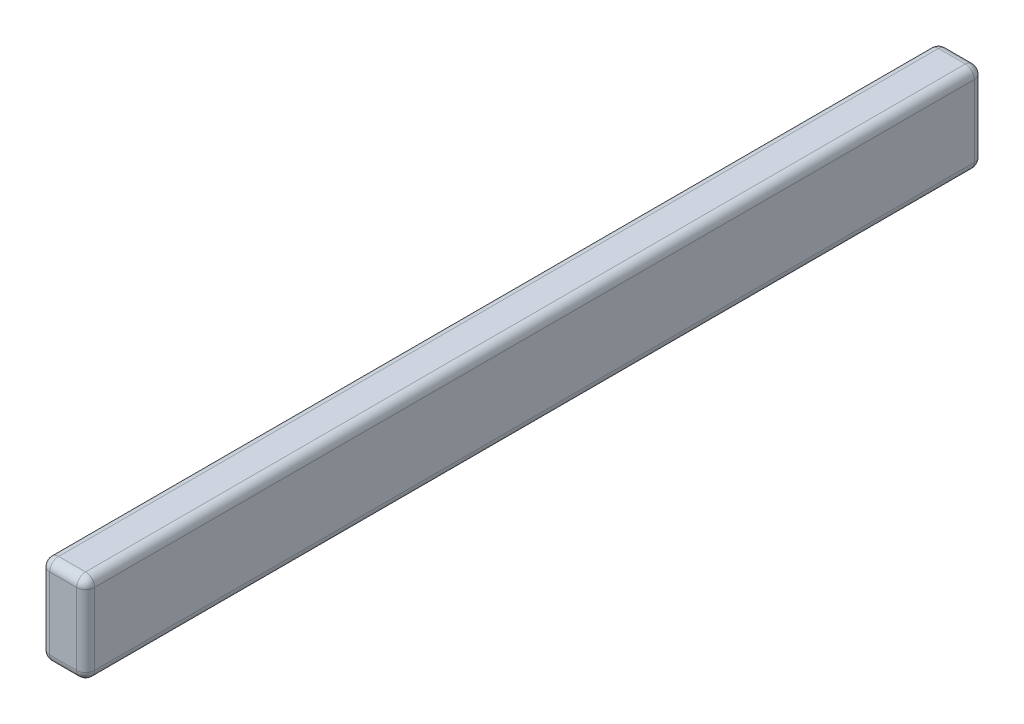
ISO-10303-21;
HEADER;
FILE_DESCRIPTION(('STEP AP214'),'2;1');
FILE_NAME('part.step','',(''),(''),'','','');
FILE_SCHEMA(('AUTOMOTIVE_DESIGN { 1 0 10303 214 1 1 1 1 }'));
ENDSEC;
DATA;
#1=APPLICATION_CONTEXT('core data for automotive mechanical design processes');
#2=APPLICATION_PROTOCOL_DEFINITION('international standard','automotive_design',2000,#1);
#3=PRODUCT_CONTEXT('',#1,'mechanical');
#4=PRODUCT('Part','Part','',(#3));
#5=PRODUCT_RELATED_PRODUCT_CATEGORY('part','',(#4));
#6=PRODUCT_DEFINITION_FORMATION('','',#4);
#7=PRODUCT_DEFINITION_CONTEXT('part definition',#1,'design');
#8=PRODUCT_DEFINITION('design','',#6,#7);
#9=PRODUCT_DEFINITION_SHAPE('','',#8);
#10=(LENGTH_UNIT() NAMED_UNIT(*) SI_UNIT(.MILLI.,.METRE.));
#11=(NAMED_UNIT(*) PLANE_ANGLE_UNIT() SI_UNIT($,.RADIAN.));
#12=(NAMED_UNIT(*) SI_UNIT($,.STERADIAN.) SOLID_ANGLE_UNIT());
#13=UNCERTAINTY_MEASURE_WITH_UNIT(LENGTH_MEASURE(1.E-05),#10,'distance_accuracy_value','');
#14=(GEOMETRIC_REPRESENTATION_CONTEXT(3) GLOBAL_UNCERTAINTY_ASSIGNED_CONTEXT((#13)) GLOBAL_UNIT_ASSIGNED_CONTEXT((#10,
#11,#12)) REPRESENTATION_CONTEXT('',''));
#15=CARTESIAN_POINT('',(0.,0.,0.));
#16=DIRECTION('',(0.,0.,1.));
#17=DIRECTION('',(1.,0.,0.));
#18=AXIS2_PLACEMENT_3D('',#15,#16,#17);
#19=CARTESIAN_POINT('',(-28.2934494803903,24.9697429906542,1000.));
#20=DIRECTION('',(1.,0.,0.));
#21=DIRECTION('',(0.,1.,0.));
#22=AXIS2_PLACEMENT_3D('',#19,#20,#21);
#23=PLANE('',#22);
#24=DIRECTION('',(0.,0.,-1.));
#25=VECTOR('',#24,1.);
#26=CARTESIAN_POINT('',(-28.2934494803903,-65.0302570093458,1000.));
#27=LINE('',#26,#25);
#28=CARTESIAN_POINT('',(-28.2934494803903,-65.0302570093458,10.));
#29=VERTEX_POINT('',#28);
#30=CARTESIAN_POINT('',(-28.2934494803903,-65.0302570093458,990.));
#31=VERTEX_POINT('',#30);
#32=EDGE_CURVE('E250',#29,#31,#27,.F.);
#33=ORIENTED_EDGE('',*,*,#32,.T.);
#34=DIRECTION('',(0.,-1.,0.));
#35=VECTOR('',#34,1.);
#36=CARTESIAN_POINT('',(-28.2934494803903,14.9697429906542,990.));
#37=LINE('',#36,#35);
#38=CARTESIAN_POINT('',(-28.2934494803903,14.9697429906542,990.));
#39=VERTEX_POINT('',#38);
#40=EDGE_CURVE('E11',#31,#39,#37,.F.);
#41=ORIENTED_EDGE('',*,*,#40,.T.);
#42=DIRECTION('',(0.,0.,-1.));
#43=VECTOR('',#42,1.);
#44=CARTESIAN_POINT('',(-28.2934494803903,14.9697429906542,0.));
#45=LINE('',#44,#43);
#46=CARTESIAN_POINT('',(-28.2934494803903,14.9697429906542,10.));
#47=VERTEX_POINT('',#46);
#48=EDGE_CURVE('E252',#39,#47,#45,.T.);
#49=ORIENTED_EDGE('',*,*,#48,.T.);
#50=DIRECTION('',(0.,-1.,0.));
#51=VECTOR('',#50,1.);
#52=CARTESIAN_POINT('',(-28.2934494803903,24.9697429906542,10.));
#53=LINE('',#52,#51);
#54=EDGE_CURVE('E44',#47,#29,#53,.T.);
#55=ORIENTED_EDGE('',*,*,#54,.T.);
#56=EDGE_LOOP('',(#33,#41,#49,#55));
#57=FACE_BOUND('',#56,.T.);
#58=ADVANCED_FACE('F35',(#57),#23,.F.);
#59=CARTESIAN_POINT('',(-28.2934494803903,-75.0302570093458,1000.));
#60=DIRECTION('',(0.,1.,0.));
#61=DIRECTION('',(0.,0.,1.));
#62=AXIS2_PLACEMENT_3D('',#59,#60,#61);
#63=PLANE('',#62);
#64=DIRECTION('',(0.,0.,-1.));
#65=VECTOR('',#64,1.);
#66=CARTESIAN_POINT('',(11.7065505196098,-75.0302570093458,1000.));
#67=LINE('',#66,#65);
#68=CARTESIAN_POINT('',(11.7065505196098,-75.0302570093458,10.));
#69=VERTEX_POINT('',#68);
#70=CARTESIAN_POINT('',(11.7065505196098,-75.0302570093458,990.));
#71=VERTEX_POINT('',#70);
#72=EDGE_CURVE('E156',#69,#71,#67,.F.);
#73=ORIENTED_EDGE('',*,*,#72,.T.);
#74=DIRECTION('',(1.,0.,0.));
#75=VECTOR('',#74,1.);
#76=CARTESIAN_POINT('',(-18.2934494803903,-75.0302570093458,990.));
#77=LINE('',#76,#75);
#78=CARTESIAN_POINT('',(-18.2934494803903,-75.0302570093458,990.));
#79=VERTEX_POINT('',#78);
#80=EDGE_CURVE('E228',#71,#79,#77,.F.);
#81=ORIENTED_EDGE('',*,*,#80,.T.);
#82=DIRECTION('',(0.,0.,-1.));
#83=VECTOR('',#82,1.);
#84=CARTESIAN_POINT('',(-18.2934494803903,-75.0302570093458,1000.));
#85=LINE('',#84,#83);
#86=CARTESIAN_POINT('',(-18.2934494803903,-75.0302570093458,10.));
#87=VERTEX_POINT('',#86);
#88=EDGE_CURVE('E272',#79,#87,#85,.T.);
#89=ORIENTED_EDGE('',*,*,#88,.T.);
#90=DIRECTION('',(1.,0.,0.));
#91=VECTOR('',#90,1.);
#92=CARTESIAN_POINT('',(-28.2934494803903,-75.0302570093458,10.));
#93=LINE('',#92,#91);
#94=EDGE_CURVE('E225',#87,#69,#93,.T.);
#95=ORIENTED_EDGE('',*,*,#94,.T.);
#96=EDGE_LOOP('',(#73,#81,#89,#95));
#97=FACE_BOUND('',#96,.T.);
#98=ADVANCED_FACE('F271',(#97),#63,.F.);
#99=CARTESIAN_POINT('',(21.7065505196098,24.9697429906542,1000.));
#100=DIRECTION('',(1.,0.,0.));
#101=DIRECTION('',(0.,1.,0.));
#102=AXIS2_PLACEMENT_3D('',#99,#100,#101);
#103=PLANE('',#102);
#104=DIRECTION('',(0.,0.,-1.));
#105=VECTOR('',#104,1.);
#106=CARTESIAN_POINT('',(21.7065505196098,14.9697429906542,1000.));
#107=LINE('',#106,#105);
#108=CARTESIAN_POINT('',(21.7065505196098,14.9697429906542,10.));
#109=VERTEX_POINT('',#108);
#110=CARTESIAN_POINT('',(21.7065505196098,14.9697429906542,990.));
#111=VERTEX_POINT('',#110);
#112=EDGE_CURVE('E260',#109,#111,#107,.F.);
#113=ORIENTED_EDGE('',*,*,#112,.T.);
#114=DIRECTION('',(0.,-1.,0.));
#115=VECTOR('',#114,1.);
#116=CARTESIAN_POINT('',(21.7065505196098,24.9697429906542,990.));
#117=LINE('',#116,#115);
#118=CARTESIAN_POINT('',(21.7065505196098,-65.0302570093458,990.));
#119=VERTEX_POINT('',#118);
#120=EDGE_CURVE('E215',#111,#119,#117,.T.);
#121=ORIENTED_EDGE('',*,*,#120,.T.);
#122=DIRECTION('',(0.,0.,-1.));
#123=VECTOR('',#122,1.);
#124=CARTESIAN_POINT('',(21.7065505196098,-65.0302570093458,0.));
#125=LINE('',#124,#123);
#126=CARTESIAN_POINT('',(21.7065505196098,-65.0302570093458,10.));
#127=VERTEX_POINT('',#126);
#128=EDGE_CURVE('E285',#119,#127,#125,.T.);
#129=ORIENTED_EDGE('',*,*,#128,.T.);
#130=DIRECTION('',(0.,-1.,0.));
#131=VECTOR('',#130,1.);
#132=CARTESIAN_POINT('',(21.7065505196098,14.9697429906542,10.));
#133=LINE('',#132,#131);
#134=EDGE_CURVE('E245',#127,#109,#133,.F.);
#135=ORIENTED_EDGE('',*,*,#134,.T.);
#136=EDGE_LOOP('',(#113,#121,#129,#135));
#137=FACE_BOUND('',#136,.T.);
#138=ADVANCED_FACE('F284',(#137),#103,.T.);
#139=CARTESIAN_POINT('',(-28.2934494803903,24.9697429906542,1000.));
#140=DIRECTION('',(0.,1.,0.));
#141=DIRECTION('',(-1.,0.,0.));
#142=AXIS2_PLACEMENT_3D('',#139,#140,#141);
#143=PLANE('',#142);
#144=DIRECTION('',(0.,0.,-1.));
#145=VECTOR('',#144,1.);
#146=CARTESIAN_POINT('',(-18.2934494803903,24.9697429906542,1000.));
#147=LINE('',#146,#145);
#148=CARTESIAN_POINT('',(-18.2934494803903,24.9697429906542,10.));
#149=VERTEX_POINT('',#148);
#150=CARTESIAN_POINT('',(-18.2934494803903,24.9697429906542,990.));
#151=VERTEX_POINT('',#150);
#152=EDGE_CURVE('E131',#149,#151,#147,.F.);
#153=ORIENTED_EDGE('',*,*,#152,.T.);
#154=DIRECTION('',(1.,0.,0.));
#155=VECTOR('',#154,1.);
#156=CARTESIAN_POINT('',(-28.2934494803903,24.9697429906542,990.));
#157=LINE('',#156,#155);
#158=CARTESIAN_POINT('',(11.7065505196098,24.9697429906542,990.));
#159=VERTEX_POINT('',#158);
#160=EDGE_CURVE('E135',#151,#159,#157,.T.);
#161=ORIENTED_EDGE('',*,*,#160,.T.);
#162=DIRECTION('',(0.,0.,-1.));
#163=VECTOR('',#162,1.);
#164=CARTESIAN_POINT('',(11.7065505196098,24.9697429906542,1000.));
#165=LINE('',#164,#163);
#166=CARTESIAN_POINT('',(11.7065505196098,24.9697429906542,10.));
#167=VERTEX_POINT('',#166);
#168=EDGE_CURVE('E133',#159,#167,#165,.T.);
#169=ORIENTED_EDGE('',*,*,#168,.T.);
#170=DIRECTION('',(1.,0.,0.));
#171=VECTOR('',#170,1.);
#172=CARTESIAN_POINT('',(-18.2934494803903,24.9697429906542,10.));
#173=LINE('',#172,#171);
#174=EDGE_CURVE('E128',#167,#149,#173,.F.);
#175=ORIENTED_EDGE('',*,*,#174,.T.);
#176=EDGE_LOOP('',(#153,#161,#169,#175));
#177=FACE_BOUND('',#176,.T.);
#178=ADVANCED_FACE('F130',(#177),#143,.T.);
#179=CARTESIAN_POINT('',(0.,0.,1000.));
#180=DIRECTION('',(0.,0.,1.));
#181=DIRECTION('',(1.,0.,0.));
#182=AXIS2_PLACEMENT_3D('',#179,#180,#181);
#183=PLANE('',#182);
#184=DIRECTION('',(1.,0.,0.));
#185=VECTOR('',#184,1.);
#186=CARTESIAN_POINT('',(11.7065505196098,-65.0302570093458,1000.));
#187=LINE('',#186,#185);
#188=CARTESIAN_POINT('',(-18.2934494803903,-65.0302570093458,1000.));
#189=VERTEX_POINT('',#188);
#190=CARTESIAN_POINT('',(11.7065505196098,-65.0302570093458,1000.));
#191=VERTEX_POINT('',#190);
#192=EDGE_CURVE('E300',#189,#191,#187,.T.);
#193=ORIENTED_EDGE('',*,*,#192,.T.);
#194=DIRECTION('',(0.,-1.,0.));
#195=VECTOR('',#194,1.);
#196=CARTESIAN_POINT('',(11.7065505196098,0.,1000.));
#197=LINE('',#196,#195);
#198=CARTESIAN_POINT('',(11.7065505196098,14.9697429906542,1000.));
#199=VERTEX_POINT('',#198);
#200=EDGE_CURVE('E216',#191,#199,#197,.F.);
#201=ORIENTED_EDGE('',*,*,#200,.T.);
#202=DIRECTION('',(1.,0.,0.));
#203=VECTOR('',#202,1.);
#204=CARTESIAN_POINT('',(0.,14.9697429906542,1000.));
#205=LINE('',#204,#203);
#206=CARTESIAN_POINT('',(-18.2934494803903,14.9697429906542,1000.));
#207=VERTEX_POINT('',#206);
#208=EDGE_CURVE('E302',#199,#207,#205,.F.);
#209=ORIENTED_EDGE('',*,*,#208,.T.);
#210=DIRECTION('',(0.,-1.,0.));
#211=VECTOR('',#210,1.);
#212=CARTESIAN_POINT('',(-18.2934494803903,-65.0302570093458,1000.));
#213=LINE('',#212,#211);
#214=EDGE_CURVE('E298',#207,#189,#213,.T.);
#215=ORIENTED_EDGE('',*,*,#214,.T.);
#216=EDGE_LOOP('',(#193,#201,#209,#215));
#217=FACE_BOUND('',#216,.T.);
#218=ADVANCED_FACE('F307',(#217),#183,.T.);
#219=CARTESIAN_POINT('',(0.,0.,0.));
#220=DIRECTION('',(0.,0.,1.));
#221=DIRECTION('',(1.,0.,0.));
#222=AXIS2_PLACEMENT_3D('',#219,#220,#221);
#223=PLANE('',#222);
#224=DIRECTION('',(1.,0.,0.));
#225=VECTOR('',#224,1.);
#226=CARTESIAN_POINT('',(11.7065505196098,14.9697429906542,0.));
#227=LINE('',#226,#225);
#228=CARTESIAN_POINT('',(-18.2934494803903,14.9697429906542,0.));
#229=VERTEX_POINT('',#228);
#230=CARTESIAN_POINT('',(11.7065505196098,14.9697429906542,0.));
#231=VERTEX_POINT('',#230);
#232=EDGE_CURVE('E159',#229,#231,#227,.T.);
#233=ORIENTED_EDGE('',*,*,#232,.T.);
#234=DIRECTION('',(0.,-1.,0.));
#235=VECTOR('',#234,1.);
#236=CARTESIAN_POINT('',(11.7065505196098,-65.0302570093458,0.));
#237=LINE('',#236,#235);
#238=CARTESIAN_POINT('',(11.7065505196098,-65.0302570093458,0.));
#239=VERTEX_POINT('',#238);
#240=EDGE_CURVE('E60',#231,#239,#237,.T.);
#241=ORIENTED_EDGE('',*,*,#240,.T.);
#242=DIRECTION('',(1.,0.,0.));
#243=VECTOR('',#242,1.);
#244=CARTESIAN_POINT('',(0.,-65.0302570093458,0.));
#245=LINE('',#244,#243);
#246=CARTESIAN_POINT('',(-18.2934494803903,-65.0302570093458,0.));
#247=VERTEX_POINT('',#246);
#248=EDGE_CURVE('E241',#239,#247,#245,.F.);
#249=ORIENTED_EDGE('',*,*,#248,.T.);
#250=DIRECTION('',(0.,-1.,0.));
#251=VECTOR('',#250,1.);
#252=CARTESIAN_POINT('',(-18.2934494803903,0.,0.));
#253=LINE('',#252,#251);
#254=EDGE_CURVE('E239',#247,#229,#253,.F.);
#255=ORIENTED_EDGE('',*,*,#254,.T.);
#256=EDGE_LOOP('',(#233,#241,#249,#255));
#257=FACE_BOUND('',#256,.T.);
#258=ADVANCED_FACE('F268',(#257),#223,.F.);
#259=CARTESIAN_POINT('',(11.7065505196098,14.9697429906542,1000.));
#260=DIRECTION('',(0.,0.,-1.));
#261=DIRECTION('',(-1.,0.,0.));
#262=AXIS2_PLACEMENT_3D('',#259,#260,#261);
#263=CYLINDRICAL_SURFACE('',#262,10.);
#264=ORIENTED_EDGE('',*,*,#168,.F.);
#265=CARTESIAN_POINT('',(11.7065505196098,14.9697429906542,990.));
#266=DIRECTION('',(0.,0.,-1.));
#267=DIRECTION('',(-1.,0.,0.));
#268=AXIS2_PLACEMENT_3D('',#265,#266,#267);
#269=CIRCLE('',#268,10.);
#270=EDGE_CURVE('E230',#159,#111,#269,.T.);
#271=ORIENTED_EDGE('',*,*,#270,.T.);
#272=ORIENTED_EDGE('',*,*,#112,.F.);
#273=CARTESIAN_POINT('',(11.7065505196098,14.9697429906542,10.));
#274=DIRECTION('',(0.,0.,-1.));
#275=DIRECTION('',(-1.,0.,0.));
#276=AXIS2_PLACEMENT_3D('',#273,#274,#275);
#277=CIRCLE('',#276,10.);
#278=EDGE_CURVE('E288',#109,#167,#277,.F.);
#279=ORIENTED_EDGE('',*,*,#278,.T.);
#280=EDGE_LOOP('',(#264,#271,#272,#279));
#281=FACE_BOUND('',#280,.T.);
#282=ADVANCED_FACE('F287',(#281),#263,.T.);
#283=CARTESIAN_POINT('',(-18.2934494803903,14.9697429906542,1000.));
#284=DIRECTION('',(0.,0.,1.));
#285=DIRECTION('',(1.,0.,0.));
#286=AXIS2_PLACEMENT_3D('',#283,#284,#285);
#287=CYLINDRICAL_SURFACE('',#286,10.);
#288=ORIENTED_EDGE('',*,*,#48,.F.);
#289=CARTESIAN_POINT('',(-18.2934494803903,14.9697429906542,990.));
#290=DIRECTION('',(0.,0.,1.));
#291=DIRECTION('',(1.,0.,0.));
#292=AXIS2_PLACEMENT_3D('',#289,#290,#291);
#293=CIRCLE('',#292,10.);
#294=EDGE_CURVE('E136',#39,#151,#293,.F.);
#295=ORIENTED_EDGE('',*,*,#294,.T.);
#296=ORIENTED_EDGE('',*,*,#152,.F.);
#297=CARTESIAN_POINT('',(-18.2934494803903,14.9697429906542,10.));
#298=DIRECTION('',(0.,0.,1.));
#299=DIRECTION('',(1.,0.,0.));
#300=AXIS2_PLACEMENT_3D('',#297,#298,#299);
#301=CIRCLE('',#300,10.);
#302=EDGE_CURVE('E144',#149,#47,#301,.T.);
#303=ORIENTED_EDGE('',*,*,#302,.T.);
#304=EDGE_LOOP('',(#288,#295,#296,#303));
#305=FACE_BOUND('',#304,.T.);
#306=ADVANCED_FACE('F143',(#305),#287,.T.);
#307=CARTESIAN_POINT('',(11.7065505196098,-65.0302570093458,1000.));
#308=DIRECTION('',(0.,0.,1.));
#309=DIRECTION('',(1.,0.,0.));
#310=AXIS2_PLACEMENT_3D('',#307,#308,#309);
#311=CYLINDRICAL_SURFACE('',#310,10.);
#312=ORIENTED_EDGE('',*,*,#128,.F.);
#313=CARTESIAN_POINT('',(11.7065505196098,-65.0302570093458,990.));
#314=DIRECTION('',(0.,0.,1.));
#315=DIRECTION('',(1.,0.,0.));
#316=AXIS2_PLACEMENT_3D('',#313,#314,#315);
#317=CIRCLE('',#316,10.);
#318=EDGE_CURVE('E220',#119,#71,#317,.F.);
#319=ORIENTED_EDGE('',*,*,#318,.T.);
#320=ORIENTED_EDGE('',*,*,#72,.F.);
#321=CARTESIAN_POINT('',(11.7065505196098,-65.0302570093458,10.));
#322=DIRECTION('',(0.,0.,1.));
#323=DIRECTION('',(1.,0.,0.));
#324=AXIS2_PLACEMENT_3D('',#321,#322,#323);
#325=CIRCLE('',#324,10.);
#326=EDGE_CURVE('E226',#69,#127,#325,.T.);
#327=ORIENTED_EDGE('',*,*,#326,.T.);
#328=EDGE_LOOP('',(#312,#319,#320,#327));
#329=FACE_BOUND('',#328,.T.);
#330=ADVANCED_FACE('F274',(#329),#311,.T.);
#331=CARTESIAN_POINT('',(-18.2934494803903,-65.0302570093458,1000.));
#332=DIRECTION('',(0.,0.,-1.));
#333=DIRECTION('',(-1.,0.,0.));
#334=AXIS2_PLACEMENT_3D('',#331,#332,#333);
#335=CYLINDRICAL_SURFACE('',#334,10.);
#336=ORIENTED_EDGE('',*,*,#88,.F.);
#337=CARTESIAN_POINT('',(-18.2934494803903,-65.0302570093458,990.));
#338=DIRECTION('',(0.,0.,-1.));
#339=DIRECTION('',(-1.,0.,0.));
#340=AXIS2_PLACEMENT_3D('',#337,#338,#339);
#341=CIRCLE('',#340,10.);
#342=EDGE_CURVE('E237',#79,#31,#341,.T.);
#343=ORIENTED_EDGE('',*,*,#342,.T.);
#344=ORIENTED_EDGE('',*,*,#32,.F.);
#345=CARTESIAN_POINT('',(-18.2934494803903,-65.0302570093458,10.));
#346=DIRECTION('',(0.,0.,-1.));
#347=DIRECTION('',(-1.,0.,0.));
#348=AXIS2_PLACEMENT_3D('',#345,#346,#347);
#349=CIRCLE('',#348,10.);
#350=EDGE_CURVE('E235',#29,#87,#349,.F.);
#351=ORIENTED_EDGE('',*,*,#350,.T.);
#352=EDGE_LOOP('',(#336,#343,#344,#351));
#353=FACE_BOUND('',#352,.T.);
#354=ADVANCED_FACE('F257',(#353),#335,.T.);
#355=CARTESIAN_POINT('',(11.7065505196098,-65.0302570093458,990.));
#356=DIRECTION('',(0.,0.,1.));
#357=DIRECTION('',(1.,0.,0.));
#358=AXIS2_PLACEMENT_3D('',#355,#356,#357);
#359=SPHERICAL_SURFACE('',#358,10.);
#360=CARTESIAN_POINT('',(11.7065505196098,-65.0302570093458,990.));
#361=DIRECTION('',(-1.,0.,0.));
#362=DIRECTION('',(0.,0.,1.));
#363=AXIS2_PLACEMENT_3D('',#360,#361,#362);
#364=CIRCLE('',#363,10.);
#365=EDGE_CURVE('E202',#71,#191,#364,.T.);
#366=ORIENTED_EDGE('',*,*,#365,.F.);
#367=ORIENTED_EDGE('',*,*,#318,.F.);
#368=CARTESIAN_POINT('',(11.7065505196098,-65.0302570093458,990.));
#369=DIRECTION('',(0.,1.,0.));
#370=DIRECTION('',(0.,0.,1.));
#371=AXIS2_PLACEMENT_3D('',#368,#369,#370);
#372=CIRCLE('',#371,10.);
#373=EDGE_CURVE('E147',#191,#119,#372,.T.);
#374=ORIENTED_EDGE('',*,*,#373,.F.);
#375=EDGE_LOOP('',(#366,#367,#374));
#376=FACE_BOUND('',#375,.T.);
#377=ADVANCED_FACE('F219',(#376),#359,.T.);
#378=CARTESIAN_POINT('',(11.7065505196098,24.9697429906542,990.));
#379=DIRECTION('',(0.,-1.,0.));
#380=DIRECTION('',(1.,0.,0.));
#381=AXIS2_PLACEMENT_3D('',#378,#379,#380);
#382=CYLINDRICAL_SURFACE('',#381,10.);
#383=ORIENTED_EDGE('',*,*,#373,.T.);
#384=ORIENTED_EDGE('',*,*,#120,.F.);
#385=CARTESIAN_POINT('',(11.7065505196098,14.9697429906542,990.));
#386=DIRECTION('',(0.,1.,0.));
#387=DIRECTION('',(-1.,0.,0.));
#388=AXIS2_PLACEMENT_3D('',#385,#386,#387);
#389=CIRCLE('',#388,10.);
#390=EDGE_CURVE('E200',#199,#111,#389,.T.);
#391=ORIENTED_EDGE('',*,*,#390,.F.);
#392=ORIENTED_EDGE('',*,*,#200,.F.);
#393=EDGE_LOOP('',(#383,#384,#391,#392));
#394=FACE_BOUND('',#393,.T.);
#395=ADVANCED_FACE('F213',(#394),#382,.T.);
#396=CARTESIAN_POINT('',(0.,-65.0302570093458,990.));
#397=DIRECTION('',(-1.,0.,0.));
#398=DIRECTION('',(0.,0.,1.));
#399=AXIS2_PLACEMENT_3D('',#396,#397,#398);
#400=CYLINDRICAL_SURFACE('',#399,10.);
#401=ORIENTED_EDGE('',*,*,#365,.T.);
#402=ORIENTED_EDGE('',*,*,#192,.F.);
#403=CARTESIAN_POINT('',(-18.2934494803903,-65.0302570093458,990.));
#404=DIRECTION('',(-1.,0.,0.));
#405=DIRECTION('',(0.,0.,1.));
#406=AXIS2_PLACEMENT_3D('',#403,#404,#405);
#407=CIRCLE('',#406,10.);
#408=EDGE_CURVE('E197',#79,#189,#407,.T.);
#409=ORIENTED_EDGE('',*,*,#408,.F.);
#410=ORIENTED_EDGE('',*,*,#80,.F.);
#411=EDGE_LOOP('',(#401,#402,#409,#410));
#412=FACE_BOUND('',#411,.T.);
#413=ADVANCED_FACE('F320',(#412),#400,.T.);
#414=CARTESIAN_POINT('',(11.7065505196098,14.9697429906542,990.));
#415=DIRECTION('',(0.,0.,1.));
#416=DIRECTION('',(1.,0.,0.));
#417=AXIS2_PLACEMENT_3D('',#414,#415,#416);
#418=SPHERICAL_SURFACE('',#417,10.);
#419=ORIENTED_EDGE('',*,*,#390,.T.);
#420=ORIENTED_EDGE('',*,*,#270,.F.);
#421=CARTESIAN_POINT('',(11.7065505196098,14.9697429906542,990.));
#422=DIRECTION('',(-1.,0.,0.));
#423=DIRECTION('',(0.,0.,1.));
#424=AXIS2_PLACEMENT_3D('',#421,#422,#423);
#425=CIRCLE('',#424,10.);
#426=EDGE_CURVE('E194',#199,#159,#425,.T.);
#427=ORIENTED_EDGE('',*,*,#426,.F.);
#428=EDGE_LOOP('',(#419,#420,#427));
#429=FACE_BOUND('',#428,.T.);
#430=ADVANCED_FACE('F311',(#429),#418,.T.);
#431=CARTESIAN_POINT('',(-18.2934494803903,-65.0302570093458,990.));
#432=DIRECTION('',(0.,0.,1.));
#433=DIRECTION('',(1.,0.,0.));
#434=AXIS2_PLACEMENT_3D('',#431,#432,#433);
#435=SPHERICAL_SURFACE('',#434,10.);
#436=ORIENTED_EDGE('',*,*,#342,.F.);
#437=ORIENTED_EDGE('',*,*,#408,.T.);
#438=CARTESIAN_POINT('',(-18.2934494803903,-65.0302570093458,990.));
#439=DIRECTION('',(0.,1.,0.));
#440=DIRECTION('',(0.,0.,1.));
#441=AXIS2_PLACEMENT_3D('',#438,#439,#440);
#442=CIRCLE('',#441,10.);
#443=EDGE_CURVE('E188',#31,#189,#442,.T.);
#444=ORIENTED_EDGE('',*,*,#443,.F.);
#445=EDGE_LOOP('',(#436,#437,#444));
#446=FACE_BOUND('',#445,.T.);
#447=ADVANCED_FACE('F322',(#446),#435,.T.);
#448=CARTESIAN_POINT('',(-28.2934494803903,14.9697429906542,990.));
#449=DIRECTION('',(1.,0.,0.));
#450=DIRECTION('',(0.,1.,0.));
#451=AXIS2_PLACEMENT_3D('',#448,#449,#450);
#452=CYLINDRICAL_SURFACE('',#451,10.);
#453=ORIENTED_EDGE('',*,*,#426,.T.);
#454=ORIENTED_EDGE('',*,*,#160,.F.);
#455=CARTESIAN_POINT('',(-18.2934494803903,14.9697429906542,990.));
#456=DIRECTION('',(-1.,0.,0.));
#457=DIRECTION('',(0.,0.,1.));
#458=AXIS2_PLACEMENT_3D('',#455,#456,#457);
#459=CIRCLE('',#458,10.);
#460=EDGE_CURVE('E183',#207,#151,#459,.T.);
#461=ORIENTED_EDGE('',*,*,#460,.F.);
#462=ORIENTED_EDGE('',*,*,#208,.F.);
#463=EDGE_LOOP('',(#453,#454,#461,#462));
#464=FACE_BOUND('',#463,.T.);
#465=ADVANCED_FACE('F314',(#464),#452,.T.);
#466=CARTESIAN_POINT('',(-18.2934494803903,0.,990.));
#467=DIRECTION('',(0.,1.,0.));
#468=DIRECTION('',(-1.,0.,0.));
#469=AXIS2_PLACEMENT_3D('',#466,#467,#468);
#470=CYLINDRICAL_SURFACE('',#469,10.);
#471=ORIENTED_EDGE('',*,*,#443,.T.);
#472=ORIENTED_EDGE('',*,*,#214,.F.);
#473=CARTESIAN_POINT('',(-18.2934494803903,14.9697429906542,990.));
#474=DIRECTION('',(0.,1.,0.));
#475=DIRECTION('',(-1.,0.,0.));
#476=AXIS2_PLACEMENT_3D('',#473,#474,#475);
#477=CIRCLE('',#476,10.);
#478=EDGE_CURVE('E179',#39,#207,#477,.T.);
#479=ORIENTED_EDGE('',*,*,#478,.F.);
#480=ORIENTED_EDGE('',*,*,#40,.F.);
#481=EDGE_LOOP('',(#471,#472,#479,#480));
#482=FACE_BOUND('',#481,.T.);
#483=ADVANCED_FACE('F317',(#482),#470,.T.);
#484=CARTESIAN_POINT('',(-18.2934494803903,14.9697429906542,990.));
#485=DIRECTION('',(0.,0.,1.));
#486=DIRECTION('',(1.,0.,0.));
#487=AXIS2_PLACEMENT_3D('',#484,#485,#486);
#488=SPHERICAL_SURFACE('',#487,10.);
#489=ORIENTED_EDGE('',*,*,#460,.T.);
#490=ORIENTED_EDGE('',*,*,#294,.F.);
#491=ORIENTED_EDGE('',*,*,#478,.T.);
#492=EDGE_LOOP('',(#489,#490,#491));
#493=FACE_BOUND('',#492,.T.);
#494=ADVANCED_FACE('F323',(#493),#488,.T.);
#495=CARTESIAN_POINT('',(11.7065505196098,-65.0302570093458,10.));
#496=DIRECTION('',(0.,0.,1.));
#497=DIRECTION('',(1.,0.,0.));
#498=AXIS2_PLACEMENT_3D('',#495,#496,#497);
#499=SPHERICAL_SURFACE('',#498,10.);
#500=CARTESIAN_POINT('',(11.7065505196098,-65.0302570093458,10.));
#501=DIRECTION('',(0.,1.,0.));
#502=DIRECTION('',(0.,0.,1.));
#503=AXIS2_PLACEMENT_3D('',#500,#501,#502);
#504=CIRCLE('',#503,10.);
#505=EDGE_CURVE('E173',#127,#239,#504,.T.);
#506=ORIENTED_EDGE('',*,*,#505,.F.);
#507=ORIENTED_EDGE('',*,*,#326,.F.);
#508=CARTESIAN_POINT('',(11.7065505196098,-65.0302570093458,10.));
#509=DIRECTION('',(-1.,0.,0.));
#510=DIRECTION('',(0.,0.,1.));
#511=AXIS2_PLACEMENT_3D('',#508,#509,#510);
#512=CIRCLE('',#511,10.);
#513=EDGE_CURVE('E39',#239,#69,#512,.T.);
#514=ORIENTED_EDGE('',*,*,#513,.F.);
#515=EDGE_LOOP('',(#506,#507,#514));
#516=FACE_BOUND('',#515,.T.);
#517=ADVANCED_FACE('F37',(#516),#499,.T.);
#518=CARTESIAN_POINT('',(-28.2934494803903,-65.0302570093458,10.));
#519=DIRECTION('',(1.,0.,0.));
#520=DIRECTION('',(0.,0.,-1.));
#521=AXIS2_PLACEMENT_3D('',#518,#519,#520);
#522=CYLINDRICAL_SURFACE('',#521,10.);
#523=ORIENTED_EDGE('',*,*,#513,.T.);
#524=ORIENTED_EDGE('',*,*,#94,.F.);
#525=CARTESIAN_POINT('',(-18.2934494803903,-65.0302570093458,10.));
#526=DIRECTION('',(-1.,0.,0.));
#527=DIRECTION('',(0.,0.,1.));
#528=AXIS2_PLACEMENT_3D('',#525,#526,#527);
#529=CIRCLE('',#528,10.);
#530=EDGE_CURVE('E171',#247,#87,#529,.T.);
#531=ORIENTED_EDGE('',*,*,#530,.F.);
#532=ORIENTED_EDGE('',*,*,#248,.F.);
#533=EDGE_LOOP('',(#523,#524,#531,#532));
#534=FACE_BOUND('',#533,.T.);
#535=ADVANCED_FACE('F269',(#534),#522,.T.);
#536=CARTESIAN_POINT('',(11.7065505196098,0.,10.));
#537=DIRECTION('',(0.,1.,0.));
#538=DIRECTION('',(-1.,0.,0.));
#539=AXIS2_PLACEMENT_3D('',#536,#537,#538);
#540=CYLINDRICAL_SURFACE('',#539,10.);
#541=ORIENTED_EDGE('',*,*,#505,.T.);
#542=ORIENTED_EDGE('',*,*,#240,.F.);
#543=CARTESIAN_POINT('',(11.7065505196098,14.9697429906542,10.));
#544=DIRECTION('',(0.,1.,0.));
#545=DIRECTION('',(-1.,0.,0.));
#546=AXIS2_PLACEMENT_3D('',#543,#544,#545);
#547=CIRCLE('',#546,10.);
#548=EDGE_CURVE('E169',#109,#231,#547,.T.);
#549=ORIENTED_EDGE('',*,*,#548,.F.);
#550=ORIENTED_EDGE('',*,*,#134,.F.);
#551=EDGE_LOOP('',(#541,#542,#549,#550));
#552=FACE_BOUND('',#551,.T.);
#553=ADVANCED_FACE('F279',(#552),#540,.T.);
#554=CARTESIAN_POINT('',(-18.2934494803903,-65.0302570093458,10.));
#555=DIRECTION('',(0.,0.,1.));
#556=DIRECTION('',(1.,0.,0.));
#557=AXIS2_PLACEMENT_3D('',#554,#555,#556);
#558=SPHERICAL_SURFACE('',#557,10.);
#559=ORIENTED_EDGE('',*,*,#530,.T.);
#560=ORIENTED_EDGE('',*,*,#350,.F.);
#561=CARTESIAN_POINT('',(-18.2934494803903,-65.0302570093458,10.));
#562=DIRECTION('',(0.,1.,0.));
#563=DIRECTION('',(0.,0.,1.));
#564=AXIS2_PLACEMENT_3D('',#561,#562,#563);
#565=CIRCLE('',#564,10.);
#566=EDGE_CURVE('E166',#247,#29,#565,.T.);
#567=ORIENTED_EDGE('',*,*,#566,.F.);
#568=EDGE_LOOP('',(#559,#560,#567));
#569=FACE_BOUND('',#568,.T.);
#570=ADVANCED_FACE('F264',(#569),#558,.T.);
#571=CARTESIAN_POINT('',(11.7065505196098,14.9697429906542,10.));
#572=DIRECTION('',(0.,0.,1.));
#573=DIRECTION('',(1.,0.,0.));
#574=AXIS2_PLACEMENT_3D('',#571,#572,#573);
#575=SPHERICAL_SURFACE('',#574,10.);
#576=ORIENTED_EDGE('',*,*,#278,.F.);
#577=ORIENTED_EDGE('',*,*,#548,.T.);
#578=CARTESIAN_POINT('',(11.7065505196098,14.9697429906542,10.));
#579=DIRECTION('',(-1.,0.,0.));
#580=DIRECTION('',(0.,0.,1.));
#581=AXIS2_PLACEMENT_3D('',#578,#579,#580);
#582=CIRCLE('',#581,10.);
#583=EDGE_CURVE('E52',#167,#231,#582,.T.);
#584=ORIENTED_EDGE('',*,*,#583,.F.);
#585=EDGE_LOOP('',(#576,#577,#584));
#586=FACE_BOUND('',#585,.T.);
#587=ADVANCED_FACE('F362',(#586),#575,.T.);
#588=CARTESIAN_POINT('',(-18.2934494803903,24.9697429906542,10.));
#589=DIRECTION('',(0.,-1.,0.));
#590=DIRECTION('',(1.,0.,0.));
#591=AXIS2_PLACEMENT_3D('',#588,#589,#590);
#592=CYLINDRICAL_SURFACE('',#591,10.);
#593=ORIENTED_EDGE('',*,*,#566,.T.);
#594=ORIENTED_EDGE('',*,*,#54,.F.);
#595=CARTESIAN_POINT('',(-18.2934494803903,14.9697429906542,10.));
#596=DIRECTION('',(0.,1.,0.));
#597=DIRECTION('',(-1.,0.,0.));
#598=AXIS2_PLACEMENT_3D('',#595,#596,#597);
#599=CIRCLE('',#598,10.);
#600=EDGE_CURVE('E154',#229,#47,#599,.T.);
#601=ORIENTED_EDGE('',*,*,#600,.F.);
#602=ORIENTED_EDGE('',*,*,#254,.F.);
#603=EDGE_LOOP('',(#593,#594,#601,#602));
#604=FACE_BOUND('',#603,.T.);
#605=ADVANCED_FACE('F267',(#604),#592,.T.);
#606=CARTESIAN_POINT('',(0.,14.9697429906542,10.));
#607=DIRECTION('',(-1.,0.,0.));
#608=DIRECTION('',(0.,-1.,0.));
#609=AXIS2_PLACEMENT_3D('',#606,#607,#608);
#610=CYLINDRICAL_SURFACE('',#609,10.);
#611=ORIENTED_EDGE('',*,*,#583,.T.);
#612=ORIENTED_EDGE('',*,*,#232,.F.);
#613=CARTESIAN_POINT('',(-18.2934494803903,14.9697429906542,10.));
#614=DIRECTION('',(-1.,0.,0.));
#615=DIRECTION('',(0.,0.,1.));
#616=AXIS2_PLACEMENT_3D('',#613,#614,#615);
#617=CIRCLE('',#616,10.);
#618=EDGE_CURVE('E152',#149,#229,#617,.T.);
#619=ORIENTED_EDGE('',*,*,#618,.F.);
#620=ORIENTED_EDGE('',*,*,#174,.F.);
#621=EDGE_LOOP('',(#611,#612,#619,#620));
#622=FACE_BOUND('',#621,.T.);
#623=ADVANCED_FACE('F158',(#622),#610,.T.);
#624=CARTESIAN_POINT('',(-18.2934494803903,14.9697429906542,10.));
#625=DIRECTION('',(0.,0.,1.));
#626=DIRECTION('',(1.,0.,0.));
#627=AXIS2_PLACEMENT_3D('',#624,#625,#626);
#628=SPHERICAL_SURFACE('',#627,10.);
#629=ORIENTED_EDGE('',*,*,#600,.T.);
#630=ORIENTED_EDGE('',*,*,#302,.F.);
#631=ORIENTED_EDGE('',*,*,#618,.T.);
#632=EDGE_LOOP('',(#629,#630,#631));
#633=FACE_BOUND('',#632,.T.);
#634=ADVANCED_FACE('F151',(#633),#628,.T.);
#635=CLOSED_SHELL('',(#58,#98,#138,#178,#218,#258,#282,#306,#330,#354,#377,#395,#413,#430,#447,
#465,#483,#494,#517,#535,#553,#570,#587,#605,#623,#634));
#636=MANIFOLD_SOLID_BREP('B2',#635);
#637=ADVANCED_BREP_SHAPE_REPRESENTATION('',(#18,#636),#14);
#638=SHAPE_DEFINITION_REPRESENTATION(#9,#637);
ENDSEC;
END-ISO-10303-21;
